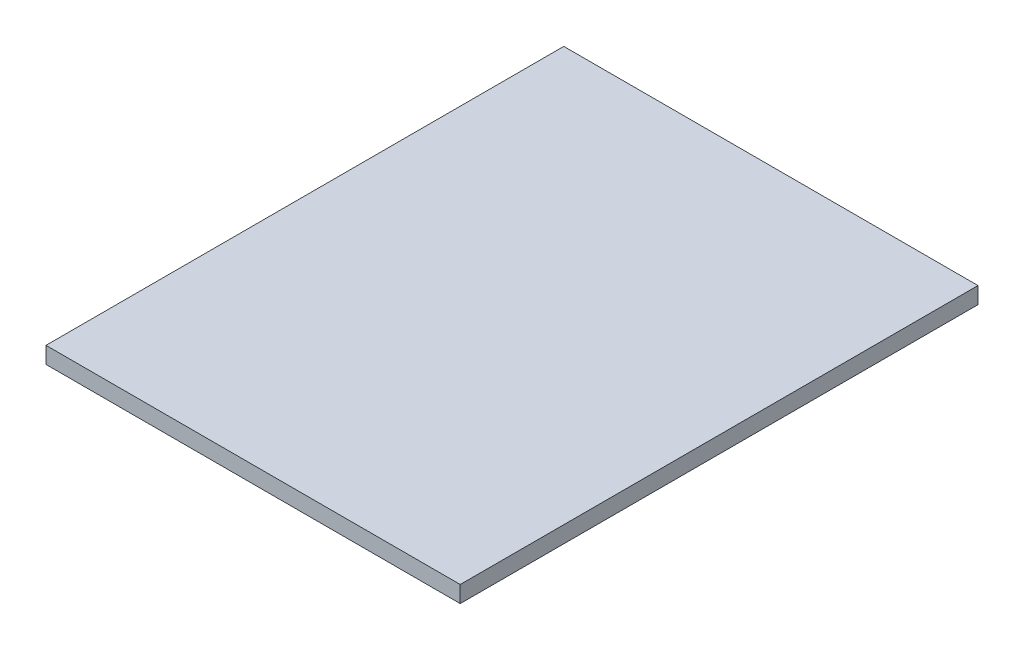
ISO-10303-21;
HEADER;
FILE_DESCRIPTION(('STEP AP214'),'2;1');
FILE_NAME('part.step','',(''),(''),'','','');
FILE_SCHEMA(('AUTOMOTIVE_DESIGN { 1 0 10303 214 1 1 1 1 }'));
ENDSEC;
DATA;
#1=APPLICATION_CONTEXT('core data for automotive mechanical design processes');
#2=APPLICATION_PROTOCOL_DEFINITION('international standard','automotive_design',2000,#1);
#3=PRODUCT_CONTEXT('',#1,'mechanical');
#4=PRODUCT('Part','Part','',(#3));
#5=PRODUCT_RELATED_PRODUCT_CATEGORY('part','',(#4));
#6=PRODUCT_DEFINITION_FORMATION('','',#4);
#7=PRODUCT_DEFINITION_CONTEXT('part definition',#1,'design');
#8=PRODUCT_DEFINITION('design','',#6,#7);
#9=PRODUCT_DEFINITION_SHAPE('','',#8);
#10=(LENGTH_UNIT() NAMED_UNIT(*) SI_UNIT(.MILLI.,.METRE.));
#11=(NAMED_UNIT(*) PLANE_ANGLE_UNIT() SI_UNIT($,.RADIAN.));
#12=(NAMED_UNIT(*) SI_UNIT($,.STERADIAN.) SOLID_ANGLE_UNIT());
#13=UNCERTAINTY_MEASURE_WITH_UNIT(LENGTH_MEASURE(1.E-05),#10,'distance_accuracy_value','');
#14=(GEOMETRIC_REPRESENTATION_CONTEXT(3) GLOBAL_UNCERTAINTY_ASSIGNED_CONTEXT((#13)) GLOBAL_UNIT_ASSIGNED_CONTEXT((#10,
#11,#12)) REPRESENTATION_CONTEXT('',''));
#15=CARTESIAN_POINT('',(0.,0.,0.));
#16=DIRECTION('',(0.,0.,1.));
#17=DIRECTION('',(1.,0.,0.));
#18=AXIS2_PLACEMENT_3D('',#15,#16,#17);
#19=CARTESIAN_POINT('',(0.,4.064,0.));
#20=DIRECTION('',(1.,0.,0.));
#21=DIRECTION('',(0.,0.,-1.));
#22=AXIS2_PLACEMENT_3D('',#19,#20,#21);
#23=PLANE('',#22);
#24=DIRECTION('',(0.,0.,1.));
#25=VECTOR('',#24,1.);
#26=CARTESIAN_POINT('',(0.,0.,0.));
#27=LINE('',#26,#25);
#28=CARTESIAN_POINT('',(0.,0.,-127.));
#29=VERTEX_POINT('',#28);
#30=CARTESIAN_POINT('',(0.,0.,0.));
#31=VERTEX_POINT('',#30);
#32=EDGE_CURVE('E100',#29,#31,#27,.T.);
#33=ORIENTED_EDGE('',*,*,#32,.T.);
#34=DIRECTION('',(0.,-1.,0.));
#35=VECTOR('',#34,1.);
#36=CARTESIAN_POINT('',(0.,4.064,0.));
#37=LINE('',#36,#35);
#38=CARTESIAN_POINT('',(0.,4.064,0.));
#39=VERTEX_POINT('',#38);
#40=EDGE_CURVE('E11',#39,#31,#37,.T.);
#41=ORIENTED_EDGE('',*,*,#40,.F.);
#42=DIRECTION('',(0.,0.,1.));
#43=VECTOR('',#42,1.);
#44=CARTESIAN_POINT('',(0.,4.064,0.));
#45=LINE('',#44,#43);
#46=CARTESIAN_POINT('',(0.,4.064,-127.));
#47=VERTEX_POINT('',#46);
#48=EDGE_CURVE('E88',#47,#39,#45,.T.);
#49=ORIENTED_EDGE('',*,*,#48,.F.);
#50=DIRECTION('',(0.,-1.,0.));
#51=VECTOR('',#50,1.);
#52=CARTESIAN_POINT('',(0.,4.064,-127.));
#53=LINE('',#52,#51);
#54=EDGE_CURVE('E96',#47,#29,#53,.T.);
#55=ORIENTED_EDGE('',*,*,#54,.T.);
#56=EDGE_LOOP('',(#33,#41,#49,#55));
#57=FACE_BOUND('',#56,.T.);
#58=ADVANCED_FACE('F37',(#57),#23,.F.);
#59=CARTESIAN_POINT('',(0.,4.064,0.));
#60=DIRECTION('',(0.,0.,-1.));
#61=DIRECTION('',(-1.,0.,0.));
#62=AXIS2_PLACEMENT_3D('',#59,#60,#61);
#63=PLANE('',#62);
#64=DIRECTION('',(1.,0.,0.));
#65=VECTOR('',#64,1.);
#66=CARTESIAN_POINT('',(0.,0.,0.));
#67=LINE('',#66,#65);
#68=CARTESIAN_POINT('',(101.6,0.,0.));
#69=VERTEX_POINT('',#68);
#70=EDGE_CURVE('E92',#31,#69,#67,.T.);
#71=ORIENTED_EDGE('',*,*,#70,.T.);
#72=DIRECTION('',(0.,-1.,0.));
#73=VECTOR('',#72,1.);
#74=CARTESIAN_POINT('',(101.6,4.064,0.));
#75=LINE('',#74,#73);
#76=CARTESIAN_POINT('',(101.6,4.064,0.));
#77=VERTEX_POINT('',#76);
#78=EDGE_CURVE('E45',#77,#69,#75,.T.);
#79=ORIENTED_EDGE('',*,*,#78,.F.);
#80=DIRECTION('',(1.,0.,0.));
#81=VECTOR('',#80,1.);
#82=CARTESIAN_POINT('',(0.,4.064,0.));
#83=LINE('',#82,#81);
#84=EDGE_CURVE('E83',#39,#77,#83,.T.);
#85=ORIENTED_EDGE('',*,*,#84,.F.);
#86=ORIENTED_EDGE('',*,*,#40,.T.);
#87=EDGE_LOOP('',(#71,#79,#85,#86));
#88=FACE_BOUND('',#87,.T.);
#89=ADVANCED_FACE('F91',(#88),#63,.F.);
#90=CARTESIAN_POINT('',(101.6,4.064,0.));
#91=DIRECTION('',(-1.,0.,0.));
#92=DIRECTION('',(0.,0.,1.));
#93=AXIS2_PLACEMENT_3D('',#90,#91,#92);
#94=PLANE('',#93);
#95=DIRECTION('',(0.,0.,-1.));
#96=VECTOR('',#95,1.);
#97=CARTESIAN_POINT('',(101.6,0.,0.));
#98=LINE('',#97,#96);
#99=CARTESIAN_POINT('',(101.6,0.,-127.));
#100=VERTEX_POINT('',#99);
#101=EDGE_CURVE('E70',#69,#100,#98,.T.);
#102=ORIENTED_EDGE('',*,*,#101,.T.);
#103=DIRECTION('',(0.,-1.,0.));
#104=VECTOR('',#103,1.);
#105=CARTESIAN_POINT('',(101.6,4.064,-127.));
#106=LINE('',#105,#104);
#107=CARTESIAN_POINT('',(101.6,4.064,-127.));
#108=VERTEX_POINT('',#107);
#109=EDGE_CURVE('E93',#108,#100,#106,.T.);
#110=ORIENTED_EDGE('',*,*,#109,.F.);
#111=DIRECTION('',(0.,0.,-1.));
#112=VECTOR('',#111,1.);
#113=CARTESIAN_POINT('',(101.6,4.064,0.));
#114=LINE('',#113,#112);
#115=EDGE_CURVE('E86',#77,#108,#114,.T.);
#116=ORIENTED_EDGE('',*,*,#115,.F.);
#117=ORIENTED_EDGE('',*,*,#78,.T.);
#118=EDGE_LOOP('',(#102,#110,#116,#117));
#119=FACE_BOUND('',#118,.T.);
#120=ADVANCED_FACE('F94',(#119),#94,.F.);
#121=CARTESIAN_POINT('',(0.,4.064,-127.));
#122=DIRECTION('',(0.,0.,1.));
#123=DIRECTION('',(1.,0.,0.));
#124=AXIS2_PLACEMENT_3D('',#121,#122,#123);
#125=PLANE('',#124);
#126=DIRECTION('',(-1.,0.,0.));
#127=VECTOR('',#126,1.);
#128=CARTESIAN_POINT('',(0.,0.,-127.));
#129=LINE('',#128,#127);
#130=EDGE_CURVE('E76',#100,#29,#129,.T.);
#131=ORIENTED_EDGE('',*,*,#130,.T.);
#132=ORIENTED_EDGE('',*,*,#54,.F.);
#133=DIRECTION('',(-1.,0.,0.));
#134=VECTOR('',#133,1.);
#135=CARTESIAN_POINT('',(0.,4.064,-127.));
#136=LINE('',#135,#134);
#137=EDGE_CURVE('E53',#108,#47,#136,.T.);
#138=ORIENTED_EDGE('',*,*,#137,.F.);
#139=ORIENTED_EDGE('',*,*,#109,.T.);
#140=EDGE_LOOP('',(#131,#132,#138,#139));
#141=FACE_BOUND('',#140,.T.);
#142=ADVANCED_FACE('F107',(#141),#125,.F.);
#143=CARTESIAN_POINT('',(0.,4.064,0.));
#144=DIRECTION('',(0.,-1.,0.));
#145=DIRECTION('',(0.,0.,-1.));
#146=AXIS2_PLACEMENT_3D('',#143,#144,#145);
#147=PLANE('',#146);
#148=ORIENTED_EDGE('',*,*,#48,.T.);
#149=ORIENTED_EDGE('',*,*,#84,.T.);
#150=ORIENTED_EDGE('',*,*,#115,.T.);
#151=ORIENTED_EDGE('',*,*,#137,.T.);
#152=EDGE_LOOP('',(#148,#149,#150,#151));
#153=FACE_BOUND('',#152,.T.);
#154=ADVANCED_FACE('F84',(#153),#147,.F.);
#155=CARTESIAN_POINT('',(0.,0.,0.));
#156=DIRECTION('',(0.,-1.,0.));
#157=DIRECTION('',(0.,0.,-1.));
#158=AXIS2_PLACEMENT_3D('',#155,#156,#157);
#159=PLANE('',#158);
#160=ORIENTED_EDGE('',*,*,#32,.F.);
#161=ORIENTED_EDGE('',*,*,#130,.F.);
#162=ORIENTED_EDGE('',*,*,#101,.F.);
#163=ORIENTED_EDGE('',*,*,#70,.F.);
#164=EDGE_LOOP('',(#160,#161,#162,#163));
#165=FACE_BOUND('',#164,.T.);
#166=ADVANCED_FACE('F110',(#165),#159,.T.);
#167=CLOSED_SHELL('',(#58,#89,#120,#142,#154,#166));
#168=MANIFOLD_SOLID_BREP('B2',#167);
#169=ADVANCED_BREP_SHAPE_REPRESENTATION('',(#18,#168),#14);
#170=SHAPE_DEFINITION_REPRESENTATION(#9,#169);
ENDSEC;
END-ISO-10303-21;
